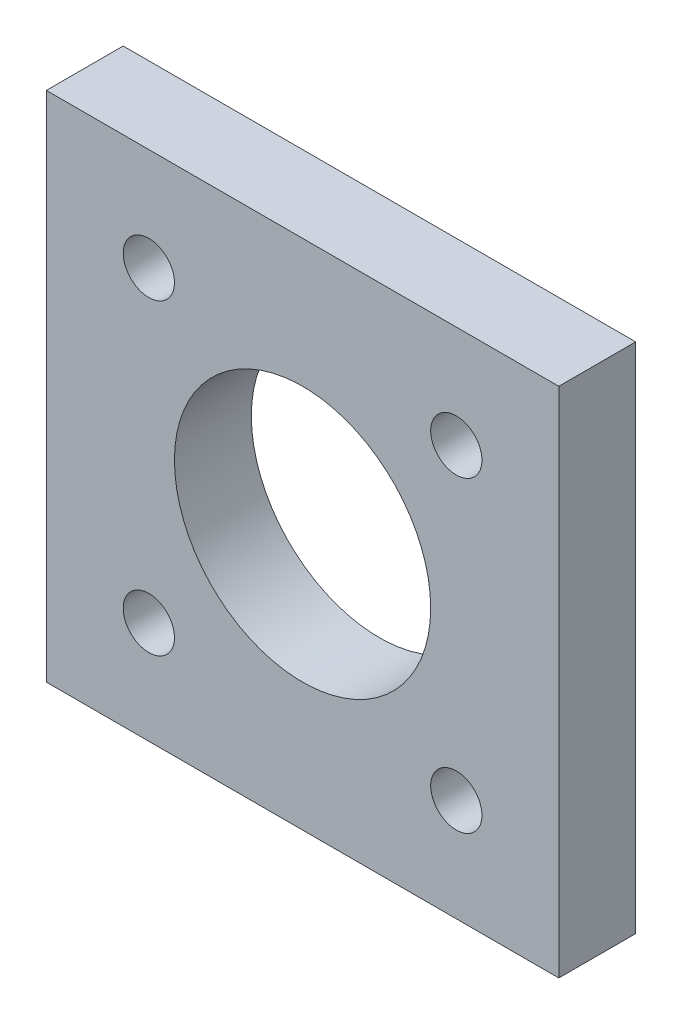
ISO-10303-21;
HEADER;
FILE_DESCRIPTION(('STEP AP214'),'2;1');
FILE_NAME('part.step','',(''),(''),'','','');
FILE_SCHEMA(('AUTOMOTIVE_DESIGN { 1 0 10303 214 1 1 1 1 }'));
ENDSEC;
DATA;
#1=APPLICATION_CONTEXT('core data for automotive mechanical design processes');
#2=APPLICATION_PROTOCOL_DEFINITION('international standard','automotive_design',2000,#1);
#3=PRODUCT_CONTEXT('',#1,'mechanical');
#4=PRODUCT('Part','Part','',(#3));
#5=PRODUCT_RELATED_PRODUCT_CATEGORY('part','',(#4));
#6=PRODUCT_DEFINITION_FORMATION('','',#4);
#7=PRODUCT_DEFINITION_CONTEXT('part definition',#1,'design');
#8=PRODUCT_DEFINITION('design','',#6,#7);
#9=PRODUCT_DEFINITION_SHAPE('','',#8);
#10=(LENGTH_UNIT() NAMED_UNIT(*) SI_UNIT(.MILLI.,.METRE.));
#11=(NAMED_UNIT(*) PLANE_ANGLE_UNIT() SI_UNIT($,.RADIAN.));
#12=(NAMED_UNIT(*) SI_UNIT($,.STERADIAN.) SOLID_ANGLE_UNIT());
#13=UNCERTAINTY_MEASURE_WITH_UNIT(LENGTH_MEASURE(1.E-05),#10,'distance_accuracy_value','');
#14=(GEOMETRIC_REPRESENTATION_CONTEXT(3) GLOBAL_UNCERTAINTY_ASSIGNED_CONTEXT((#13)) GLOBAL_UNIT_ASSIGNED_CONTEXT((#10,
#11,#12)) REPRESENTATION_CONTEXT('',''));
#15=CARTESIAN_POINT('',(0.,0.,0.));
#16=DIRECTION('',(0.,0.,1.));
#17=DIRECTION('',(1.,0.,0.));
#18=AXIS2_PLACEMENT_3D('',#15,#16,#17);
#19=CARTESIAN_POINT('',(0.,0.,6.));
#20=DIRECTION('',(0.,0.,-1.));
#21=DIRECTION('',(-1.,0.,0.));
#22=AXIS2_PLACEMENT_3D('',#19,#20,#21);
#23=PLANE('',#22);
#24=DIRECTION('',(0.,1.,0.));
#25=VECTOR('',#24,1.);
#26=CARTESIAN_POINT('',(20.,-20.,6.));
#27=LINE('',#26,#25);
#28=CARTESIAN_POINT('',(20.,-20.,6.));
#29=VERTEX_POINT('',#28);
#30=CARTESIAN_POINT('',(20.,20.,6.));
#31=VERTEX_POINT('',#30);
#32=EDGE_CURVE('E91',#29,#31,#27,.T.);
#33=ORIENTED_EDGE('',*,*,#32,.T.);
#34=DIRECTION('',(-1.,0.,0.));
#35=VECTOR('',#34,1.);
#36=CARTESIAN_POINT('',(-20.,20.,6.));
#37=LINE('',#36,#35);
#38=CARTESIAN_POINT('',(-20.,20.,6.));
#39=VERTEX_POINT('',#38);
#40=EDGE_CURVE('E86',#31,#39,#37,.T.);
#41=ORIENTED_EDGE('',*,*,#40,.T.);
#42=DIRECTION('',(0.,-1.,0.));
#43=VECTOR('',#42,1.);
#44=CARTESIAN_POINT('',(-20.,-20.,6.));
#45=LINE('',#44,#43);
#46=CARTESIAN_POINT('',(-20.,-20.,6.));
#47=VERTEX_POINT('',#46);
#48=EDGE_CURVE('E89',#39,#47,#45,.T.);
#49=ORIENTED_EDGE('',*,*,#48,.T.);
#50=DIRECTION('',(1.,0.,0.));
#51=VECTOR('',#50,1.);
#52=CARTESIAN_POINT('',(-20.,-20.,6.));
#53=LINE('',#52,#51);
#54=EDGE_CURVE('E56',#47,#29,#53,.T.);
#55=ORIENTED_EDGE('',*,*,#54,.T.);
#56=EDGE_LOOP('',(#33,#41,#49,#55));
#57=FACE_BOUND('',#56,.T.);
#58=CARTESIAN_POINT('',(0.,0.,6.));
#59=DIRECTION('',(0.,0.,1.));
#60=DIRECTION('',(1.,0.,0.));
#61=AXIS2_PLACEMENT_3D('',#58,#59,#60);
#62=CIRCLE('',#61,10.);
#63=CARTESIAN_POINT('',(10.,0.,6.));
#64=VERTEX_POINT('',#63);
#65=EDGE_CURVE('E111',#64,#64,#62,.T.);
#66=ORIENTED_EDGE('',*,*,#65,.F.);
#67=EDGE_LOOP('',(#66));
#68=FACE_BOUND('',#67,.T.);
#69=CARTESIAN_POINT('',(-12.,12.,6.));
#70=DIRECTION('',(0.,0.,1.));
#71=DIRECTION('',(1.,0.,0.));
#72=AXIS2_PLACEMENT_3D('',#69,#70,#71);
#73=CIRCLE('',#72,2.);
#74=CARTESIAN_POINT('',(-10.,12.,6.));
#75=VERTEX_POINT('',#74);
#76=EDGE_CURVE('E133',#75,#75,#73,.T.);
#77=ORIENTED_EDGE('',*,*,#76,.F.);
#78=EDGE_LOOP('',(#77));
#79=FACE_BOUND('',#78,.T.);
#80=CARTESIAN_POINT('',(12.,12.000000000001,6.));
#81=DIRECTION('',(0.,0.,1.));
#82=DIRECTION('',(1.,0.,0.));
#83=AXIS2_PLACEMENT_3D('',#80,#81,#82);
#84=CIRCLE('',#83,2.);
#85=CARTESIAN_POINT('',(14.,12.000000000001,6.));
#86=VERTEX_POINT('',#85);
#87=EDGE_CURVE('E141',#86,#86,#84,.T.);
#88=ORIENTED_EDGE('',*,*,#87,.F.);
#89=EDGE_LOOP('',(#88));
#90=FACE_BOUND('',#89,.T.);
#91=CARTESIAN_POINT('',(12.000000000001,-11.999999999999,6.));
#92=DIRECTION('',(0.,0.,1.));
#93=DIRECTION('',(1.,0.,0.));
#94=AXIS2_PLACEMENT_3D('',#91,#92,#93);
#95=CIRCLE('',#94,2.);
#96=CARTESIAN_POINT('',(14.000000000001,-11.999999999999,6.));
#97=VERTEX_POINT('',#96);
#98=EDGE_CURVE('E149',#97,#97,#95,.T.);
#99=ORIENTED_EDGE('',*,*,#98,.F.);
#100=EDGE_LOOP('',(#99));
#101=FACE_BOUND('',#100,.T.);
#102=CARTESIAN_POINT('',(-11.999999999999,-12.,6.));
#103=DIRECTION('',(0.,0.,1.));
#104=DIRECTION('',(1.,0.,0.));
#105=AXIS2_PLACEMENT_3D('',#102,#103,#104);
#106=CIRCLE('',#105,2.);
#107=CARTESIAN_POINT('',(-9.99999999999903,-12.,6.));
#108=VERTEX_POINT('',#107);
#109=EDGE_CURVE('E157',#108,#108,#106,.T.);
#110=ORIENTED_EDGE('',*,*,#109,.F.);
#111=EDGE_LOOP('',(#110));
#112=FACE_BOUND('',#111,.T.);
#113=ADVANCED_FACE('F38',(#57,#68,#79,#90,#101,#112),#23,.F.);
#114=CARTESIAN_POINT('',(0.,0.,0.));
#115=DIRECTION('',(0.,0.,-1.));
#116=DIRECTION('',(-1.,0.,0.));
#117=AXIS2_PLACEMENT_3D('',#114,#115,#116);
#118=PLANE('',#117);
#119=CARTESIAN_POINT('',(12.000000000001,-11.999999999999,0.));
#120=DIRECTION('',(0.,0.,1.));
#121=DIRECTION('',(1.,0.,0.));
#122=AXIS2_PLACEMENT_3D('',#119,#120,#121);
#123=CIRCLE('',#122,2.);
#124=CARTESIAN_POINT('',(14.000000000001,-11.999999999999,0.));
#125=VERTEX_POINT('',#124);
#126=EDGE_CURVE('E153',#125,#125,#123,.T.);
#127=ORIENTED_EDGE('',*,*,#126,.T.);
#128=EDGE_LOOP('',(#127));
#129=FACE_BOUND('',#128,.T.);
#130=CARTESIAN_POINT('',(-12.,12.,0.));
#131=DIRECTION('',(0.,0.,1.));
#132=DIRECTION('',(1.,0.,0.));
#133=AXIS2_PLACEMENT_3D('',#130,#131,#132);
#134=CIRCLE('',#133,2.);
#135=CARTESIAN_POINT('',(-10.,12.,0.));
#136=VERTEX_POINT('',#135);
#137=EDGE_CURVE('E137',#136,#136,#134,.T.);
#138=ORIENTED_EDGE('',*,*,#137,.T.);
#139=EDGE_LOOP('',(#138));
#140=FACE_BOUND('',#139,.T.);
#141=DIRECTION('',(0.,1.,0.));
#142=VECTOR('',#141,1.);
#143=CARTESIAN_POINT('',(20.,-20.,0.));
#144=LINE('',#143,#142);
#145=CARTESIAN_POINT('',(20.,-20.,0.));
#146=VERTEX_POINT('',#145);
#147=CARTESIAN_POINT('',(20.,20.,0.));
#148=VERTEX_POINT('',#147);
#149=EDGE_CURVE('E107',#146,#148,#144,.T.);
#150=ORIENTED_EDGE('',*,*,#149,.F.);
#151=DIRECTION('',(1.,0.,0.));
#152=VECTOR('',#151,1.);
#153=CARTESIAN_POINT('',(-20.,-20.,0.));
#154=LINE('',#153,#152);
#155=CARTESIAN_POINT('',(-20.,-20.,0.));
#156=VERTEX_POINT('',#155);
#157=EDGE_CURVE('E79',#156,#146,#154,.T.);
#158=ORIENTED_EDGE('',*,*,#157,.F.);
#159=DIRECTION('',(0.,-1.,0.));
#160=VECTOR('',#159,1.);
#161=CARTESIAN_POINT('',(-20.,-20.,0.));
#162=LINE('',#161,#160);
#163=CARTESIAN_POINT('',(-20.,20.,0.));
#164=VERTEX_POINT('',#163);
#165=EDGE_CURVE('E73',#164,#156,#162,.T.);
#166=ORIENTED_EDGE('',*,*,#165,.F.);
#167=DIRECTION('',(-1.,0.,0.));
#168=VECTOR('',#167,1.);
#169=CARTESIAN_POINT('',(-20.,20.,0.));
#170=LINE('',#169,#168);
#171=EDGE_CURVE('E96',#148,#164,#170,.T.);
#172=ORIENTED_EDGE('',*,*,#171,.F.);
#173=EDGE_LOOP('',(#150,#158,#166,#172));
#174=FACE_BOUND('',#173,.T.);
#175=CARTESIAN_POINT('',(0.,0.,0.));
#176=DIRECTION('',(0.,0.,1.));
#177=DIRECTION('',(1.,0.,0.));
#178=AXIS2_PLACEMENT_3D('',#175,#176,#177);
#179=CIRCLE('',#178,10.);
#180=CARTESIAN_POINT('',(10.,0.,0.));
#181=VERTEX_POINT('',#180);
#182=EDGE_CURVE('E129',#181,#181,#179,.T.);
#183=ORIENTED_EDGE('',*,*,#182,.T.);
#184=EDGE_LOOP('',(#183));
#185=FACE_BOUND('',#184,.T.);
#186=CARTESIAN_POINT('',(12.,12.000000000001,0.));
#187=DIRECTION('',(0.,0.,1.));
#188=DIRECTION('',(1.,0.,0.));
#189=AXIS2_PLACEMENT_3D('',#186,#187,#188);
#190=CIRCLE('',#189,2.);
#191=CARTESIAN_POINT('',(14.,12.000000000001,0.));
#192=VERTEX_POINT('',#191);
#193=EDGE_CURVE('E145',#192,#192,#190,.T.);
#194=ORIENTED_EDGE('',*,*,#193,.T.);
#195=EDGE_LOOP('',(#194));
#196=FACE_BOUND('',#195,.T.);
#197=CARTESIAN_POINT('',(-11.999999999999,-12.,0.));
#198=DIRECTION('',(0.,0.,1.));
#199=DIRECTION('',(1.,0.,0.));
#200=AXIS2_PLACEMENT_3D('',#197,#198,#199);
#201=CIRCLE('',#200,2.);
#202=CARTESIAN_POINT('',(-9.99999999999903,-12.,0.));
#203=VERTEX_POINT('',#202);
#204=EDGE_CURVE('E161',#203,#203,#201,.T.);
#205=ORIENTED_EDGE('',*,*,#204,.T.);
#206=EDGE_LOOP('',(#205));
#207=FACE_BOUND('',#206,.T.);
#208=ADVANCED_FACE('F124',(#129,#140,#174,#185,#196,#207),#118,.T.);
#209=CARTESIAN_POINT('',(20.,-20.,6.));
#210=DIRECTION('',(-1.,0.,0.));
#211=DIRECTION('',(0.,0.,1.));
#212=AXIS2_PLACEMENT_3D('',#209,#210,#211);
#213=PLANE('',#212);
#214=ORIENTED_EDGE('',*,*,#149,.T.);
#215=DIRECTION('',(0.,0.,-1.));
#216=VECTOR('',#215,1.);
#217=CARTESIAN_POINT('',(20.,20.,6.));
#218=LINE('',#217,#216);
#219=EDGE_CURVE('E11',#31,#148,#218,.T.);
#220=ORIENTED_EDGE('',*,*,#219,.F.);
#221=ORIENTED_EDGE('',*,*,#32,.F.);
#222=DIRECTION('',(0.,0.,-1.));
#223=VECTOR('',#222,1.);
#224=CARTESIAN_POINT('',(20.,-20.,6.));
#225=LINE('',#224,#223);
#226=EDGE_CURVE('E103',#29,#146,#225,.T.);
#227=ORIENTED_EDGE('',*,*,#226,.T.);
#228=EDGE_LOOP('',(#214,#220,#221,#227));
#229=FACE_BOUND('',#228,.T.);
#230=ADVANCED_FACE('F40',(#229),#213,.F.);
#231=CARTESIAN_POINT('',(-20.,20.,6.));
#232=DIRECTION('',(0.,-1.,0.));
#233=DIRECTION('',(0.,0.,-1.));
#234=AXIS2_PLACEMENT_3D('',#231,#232,#233);
#235=PLANE('',#234);
#236=ORIENTED_EDGE('',*,*,#171,.T.);
#237=DIRECTION('',(0.,0.,-1.));
#238=VECTOR('',#237,1.);
#239=CARTESIAN_POINT('',(-20.,20.,6.));
#240=LINE('',#239,#238);
#241=EDGE_CURVE('E48',#39,#164,#240,.T.);
#242=ORIENTED_EDGE('',*,*,#241,.F.);
#243=ORIENTED_EDGE('',*,*,#40,.F.);
#244=ORIENTED_EDGE('',*,*,#219,.T.);
#245=EDGE_LOOP('',(#236,#242,#243,#244));
#246=FACE_BOUND('',#245,.T.);
#247=ADVANCED_FACE('F95',(#246),#235,.F.);
#248=CARTESIAN_POINT('',(-20.,-20.,6.));
#249=DIRECTION('',(1.,0.,0.));
#250=DIRECTION('',(0.,0.,-1.));
#251=AXIS2_PLACEMENT_3D('',#248,#249,#250);
#252=PLANE('',#251);
#253=ORIENTED_EDGE('',*,*,#165,.T.);
#254=DIRECTION('',(0.,0.,-1.));
#255=VECTOR('',#254,1.);
#256=CARTESIAN_POINT('',(-20.,-20.,6.));
#257=LINE('',#256,#255);
#258=EDGE_CURVE('E98',#47,#156,#257,.T.);
#259=ORIENTED_EDGE('',*,*,#258,.F.);
#260=ORIENTED_EDGE('',*,*,#48,.F.);
#261=ORIENTED_EDGE('',*,*,#241,.T.);
#262=EDGE_LOOP('',(#253,#259,#260,#261));
#263=FACE_BOUND('',#262,.T.);
#264=ADVANCED_FACE('F99',(#263),#252,.F.);
#265=CARTESIAN_POINT('',(-20.,-20.,6.));
#266=DIRECTION('',(0.,1.,0.));
#267=DIRECTION('',(0.,0.,1.));
#268=AXIS2_PLACEMENT_3D('',#265,#266,#267);
#269=PLANE('',#268);
#270=ORIENTED_EDGE('',*,*,#157,.T.);
#271=ORIENTED_EDGE('',*,*,#226,.F.);
#272=ORIENTED_EDGE('',*,*,#54,.F.);
#273=ORIENTED_EDGE('',*,*,#258,.T.);
#274=EDGE_LOOP('',(#270,#271,#272,#273));
#275=FACE_BOUND('',#274,.T.);
#276=ADVANCED_FACE('F121',(#275),#269,.F.);
#277=CARTESIAN_POINT('',(0.,0.,6.));
#278=DIRECTION('',(0.,0.,-1.));
#279=DIRECTION('',(-1.,0.,0.));
#280=AXIS2_PLACEMENT_3D('',#277,#278,#279);
#281=CYLINDRICAL_SURFACE('',#280,10.);
#282=ORIENTED_EDGE('',*,*,#65,.T.);
#283=EDGE_LOOP('',(#282));
#284=FACE_BOUND('',#283,.T.);
#285=ORIENTED_EDGE('',*,*,#182,.F.);
#286=EDGE_LOOP('',(#285));
#287=FACE_BOUND('',#286,.T.);
#288=ADVANCED_FACE('F180',(#284,#287),#281,.F.);
#289=CARTESIAN_POINT('',(-12.,12.,6.));
#290=DIRECTION('',(0.,0.,-1.));
#291=DIRECTION('',(-1.,0.,0.));
#292=AXIS2_PLACEMENT_3D('',#289,#290,#291);
#293=CYLINDRICAL_SURFACE('',#292,2.);
#294=ORIENTED_EDGE('',*,*,#76,.T.);
#295=EDGE_LOOP('',(#294));
#296=FACE_BOUND('',#295,.T.);
#297=ORIENTED_EDGE('',*,*,#137,.F.);
#298=EDGE_LOOP('',(#297));
#299=FACE_BOUND('',#298,.T.);
#300=ADVANCED_FACE('F226',(#296,#299),#293,.F.);
#301=CARTESIAN_POINT('',(12.,12.000000000001,6.));
#302=DIRECTION('',(0.,0.,-1.));
#303=DIRECTION('',(-1.,0.,0.));
#304=AXIS2_PLACEMENT_3D('',#301,#302,#303);
#305=CYLINDRICAL_SURFACE('',#304,2.);
#306=ORIENTED_EDGE('',*,*,#87,.T.);
#307=EDGE_LOOP('',(#306));
#308=FACE_BOUND('',#307,.T.);
#309=ORIENTED_EDGE('',*,*,#193,.F.);
#310=EDGE_LOOP('',(#309));
#311=FACE_BOUND('',#310,.T.);
#312=ADVANCED_FACE('F234',(#308,#311),#305,.F.);
#313=CARTESIAN_POINT('',(12.000000000001,-11.999999999999,6.));
#314=DIRECTION('',(0.,0.,-1.));
#315=DIRECTION('',(-1.,0.,0.));
#316=AXIS2_PLACEMENT_3D('',#313,#314,#315);
#317=CYLINDRICAL_SURFACE('',#316,2.);
#318=ORIENTED_EDGE('',*,*,#98,.T.);
#319=EDGE_LOOP('',(#318));
#320=FACE_BOUND('',#319,.T.);
#321=ORIENTED_EDGE('',*,*,#126,.F.);
#322=EDGE_LOOP('',(#321));
#323=FACE_BOUND('',#322,.T.);
#324=ADVANCED_FACE('F242',(#320,#323),#317,.F.);
#325=CARTESIAN_POINT('',(-11.999999999999,-12.,6.));
#326=DIRECTION('',(0.,0.,-1.));
#327=DIRECTION('',(-1.,0.,0.));
#328=AXIS2_PLACEMENT_3D('',#325,#326,#327);
#329=CYLINDRICAL_SURFACE('',#328,2.);
#330=ORIENTED_EDGE('',*,*,#109,.T.);
#331=EDGE_LOOP('',(#330));
#332=FACE_BOUND('',#331,.T.);
#333=ORIENTED_EDGE('',*,*,#204,.F.);
#334=EDGE_LOOP('',(#333));
#335=FACE_BOUND('',#334,.T.);
#336=ADVANCED_FACE('F169',(#332,#335),#329,.F.);
#337=CLOSED_SHELL('',(#113,#208,#230,#247,#264,#276,#288,#300,#312,#324,#336));
#338=MANIFOLD_SOLID_BREP('B2',#337);
#339=ADVANCED_BREP_SHAPE_REPRESENTATION('',(#18,#338),#14);
#340=SHAPE_DEFINITION_REPRESENTATION(#9,#339);
ENDSEC;
END-ISO-10303-21;
